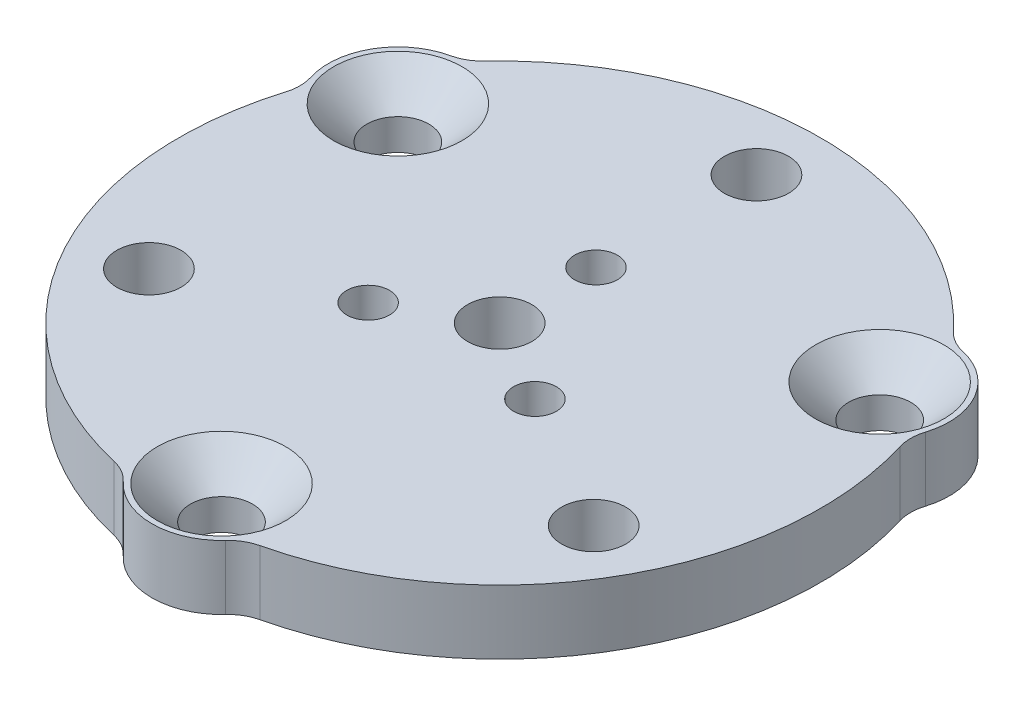
ISO-10303-21;
HEADER;
FILE_DESCRIPTION(('STEP AP214'),'2;1');
FILE_NAME('part.step','',(''),(''),'','','');
FILE_SCHEMA(('AUTOMOTIVE_DESIGN { 1 0 10303 214 1 1 1 1 }'));
ENDSEC;
DATA;
#1=APPLICATION_CONTEXT('core data for automotive mechanical design processes');
#2=APPLICATION_PROTOCOL_DEFINITION('international standard','automotive_design',2000,#1);
#3=PRODUCT_CONTEXT('',#1,'mechanical');
#4=PRODUCT('Part','Part','',(#3));
#5=PRODUCT_RELATED_PRODUCT_CATEGORY('part','',(#4));
#6=PRODUCT_DEFINITION_FORMATION('','',#4);
#7=PRODUCT_DEFINITION_CONTEXT('part definition',#1,'design');
#8=PRODUCT_DEFINITION('design','',#6,#7);
#9=PRODUCT_DEFINITION_SHAPE('','',#8);
#10=(LENGTH_UNIT() NAMED_UNIT(*) SI_UNIT(.MILLI.,.METRE.));
#11=(NAMED_UNIT(*) PLANE_ANGLE_UNIT() SI_UNIT($,.RADIAN.));
#12=(NAMED_UNIT(*) SI_UNIT($,.STERADIAN.) SOLID_ANGLE_UNIT());
#13=UNCERTAINTY_MEASURE_WITH_UNIT(LENGTH_MEASURE(1.E-05),#10,'distance_accuracy_value','');
#14=(GEOMETRIC_REPRESENTATION_CONTEXT(3) GLOBAL_UNCERTAINTY_ASSIGNED_CONTEXT((#13)) GLOBAL_UNIT_ASSIGNED_CONTEXT((#10,
#11,#12)) REPRESENTATION_CONTEXT('',''));
#15=CARTESIAN_POINT('',(0.,0.,0.));
#16=DIRECTION('',(0.,0.,1.));
#17=DIRECTION('',(1.,0.,0.));
#18=AXIS2_PLACEMENT_3D('',#15,#16,#17);
#19=CARTESIAN_POINT('',(0.,3.,0.));
#20=DIRECTION('',(0.,-1.,0.));
#21=DIRECTION('',(0.,0.,-1.));
#22=AXIS2_PLACEMENT_3D('',#19,#20,#21);
#23=CYLINDRICAL_SURFACE('',#22,15.);
#24=CARTESIAN_POINT('',(0.,3.,0.));
#25=DIRECTION('',(0.,1.,0.));
#26=DIRECTION('',(0.,0.,1.));
#27=AXIS2_PLACEMENT_3D('',#24,#25,#26);
#28=CIRCLE('',#27,15.);
#29=CARTESIAN_POINT('',(10.9463141513856,3.,-10.2556426663167));
#30=VERTEX_POINT('',#29);
#31=CARTESIAN_POINT('',(-10.9463141513855,3.,-10.2556426663168));
#32=VERTEX_POINT('',#31);
#33=EDGE_CURVE('E148',#30,#32,#28,.T.);
#34=ORIENTED_EDGE('',*,*,#33,.F.);
#35=DIRECTION('',(0.,-1.,0.));
#36=VECTOR('',#35,1.);
#37=CARTESIAN_POINT('',(10.9463141513856,3.,-10.2556426663167));
#38=LINE('',#37,#36);
#39=CARTESIAN_POINT('',(10.9463141513856,0.,-10.2556426663167));
#40=VERTEX_POINT('',#39);
#41=EDGE_CURVE('E133',#30,#40,#38,.T.);
#42=ORIENTED_EDGE('',*,*,#41,.T.);
#43=CARTESIAN_POINT('',(0.,0.,0.));
#44=DIRECTION('',(0.,1.,0.));
#45=DIRECTION('',(0.,0.,1.));
#46=AXIS2_PLACEMENT_3D('',#43,#44,#45);
#47=CIRCLE('',#46,15.);
#48=CARTESIAN_POINT('',(-10.9463141513855,0.,-10.2556426663168));
#49=VERTEX_POINT('',#48);
#50=EDGE_CURVE('E146',#40,#49,#47,.T.);
#51=ORIENTED_EDGE('',*,*,#50,.T.);
#52=DIRECTION('',(0.,-1.,0.));
#53=VECTOR('',#52,1.);
#54=CARTESIAN_POINT('',(-10.9463141513855,3.,-10.2556426663168));
#55=LINE('',#54,#53);
#56=EDGE_CURVE('E151',#49,#32,#55,.F.);
#57=ORIENTED_EDGE('',*,*,#56,.T.);
#58=EDGE_LOOP('',(#34,#42,#51,#57));
#59=FACE_BOUND('',#58,.T.);
#60=ADVANCED_FACE('F40',(#59),#23,.T.);
#61=CARTESIAN_POINT('',(-14.3548041568587,0.,-4.35196479974656));
#62=VERTEX_POINT('',#61);
#63=CARTESIAN_POINT('',(-3.40849000547315,0.,14.6076074660633));
#64=VERTEX_POINT('',#63);
#65=EDGE_CURVE('E160',#62,#64,#47,.T.);
#66=ORIENTED_EDGE('',*,*,#65,.T.);
#67=DIRECTION('',(0.,-1.,0.));
#68=VECTOR('',#67,1.);
#69=CARTESIAN_POINT('',(-3.40849000547315,3.,14.6076074660633));
#70=LINE('',#69,#68);
#71=CARTESIAN_POINT('',(-3.40849000547315,3.,14.6076074660633));
#72=VERTEX_POINT('',#71);
#73=EDGE_CURVE('E269',#64,#72,#70,.F.);
#74=ORIENTED_EDGE('',*,*,#73,.T.);
#75=CARTESIAN_POINT('',(-14.3548041568587,3.,-4.35196479974656));
#76=VERTEX_POINT('',#75);
#77=EDGE_CURVE('E167',#76,#72,#28,.T.);
#78=ORIENTED_EDGE('',*,*,#77,.F.);
#79=DIRECTION('',(0.,-1.,0.));
#80=VECTOR('',#79,1.);
#81=CARTESIAN_POINT('',(-14.3548041568587,3.,-4.35196479974656));
#82=LINE('',#81,#80);
#83=EDGE_CURVE('E265',#76,#62,#82,.T.);
#84=ORIENTED_EDGE('',*,*,#83,.T.);
#85=EDGE_LOOP('',(#66,#74,#78,#84));
#86=FACE_BOUND('',#85,.T.);
#87=ADVANCED_FACE('F387',(#86),#23,.T.);
#88=CARTESIAN_POINT('',(0.,3.,0.));
#89=DIRECTION('',(0.,1.,0.));
#90=DIRECTION('',(0.,0.,1.));
#91=AXIS2_PLACEMENT_3D('',#88,#89,#90);
#92=PLANE('',#91);
#93=CARTESIAN_POINT('',(-11.2583302491977,3.,-6.5));
#94=DIRECTION('',(0.,1.,0.));
#95=DIRECTION('',(0.,0.,1.));
#96=AXIS2_PLACEMENT_3D('',#93,#94,#95);
#97=CIRCLE('',#96,2.99999999999994);
#98=CARTESIAN_POINT('',(-11.2583302491977,3.,-3.50000000000005));
#99=VERTEX_POINT('',#98);
#100=EDGE_CURVE('E238',#99,#99,#97,.F.);
#101=ORIENTED_EDGE('',*,*,#100,.T.);
#102=EDGE_LOOP('',(#101));
#103=FACE_BOUND('',#102,.T.);
#104=CARTESIAN_POINT('',(0.,3.,13.));
#105=DIRECTION('',(0.,1.,0.));
#106=DIRECTION('',(0.,0.,1.));
#107=AXIS2_PLACEMENT_3D('',#104,#105,#106);
#108=CIRCLE('',#107,3.);
#109=CARTESIAN_POINT('',(0.,3.,16.));
#110=VERTEX_POINT('',#109);
#111=EDGE_CURVE('E234',#110,#110,#108,.F.);
#112=ORIENTED_EDGE('',*,*,#111,.T.);
#113=EDGE_LOOP('',(#112));
#114=FACE_BOUND('',#113,.T.);
#115=CARTESIAN_POINT('',(11.2583302491978,3.,-6.49999999999989));
#116=DIRECTION('',(0.,1.,0.));
#117=DIRECTION('',(0.,0.,1.));
#118=AXIS2_PLACEMENT_3D('',#115,#116,#117);
#119=CIRCLE('',#118,3.);
#120=CARTESIAN_POINT('',(11.2583302491978,3.,-3.49999999999989));
#121=VERTEX_POINT('',#120);
#122=EDGE_CURVE('E231',#121,#121,#119,.F.);
#123=ORIENTED_EDGE('',*,*,#122,.T.);
#124=EDGE_LOOP('',(#123));
#125=FACE_BOUND('',#124,.T.);
#126=CARTESIAN_POINT('',(11.2583302491978,3.,-6.49999999999989));
#127=DIRECTION('',(0.,1.,0.));
#128=DIRECTION('',(0.,0.,1.));
#129=AXIS2_PLACEMENT_3D('',#126,#127,#128);
#130=CIRCLE('',#129,3.25);
#131=CARTESIAN_POINT('',(14.3600360272048,3.,-5.52947371664746));
#132=VERTEX_POINT('',#131);
#133=CARTESIAN_POINT('',(11.9686827217776,3.,-9.67141914049515));
#134=VERTEX_POINT('',#133);
#135=EDGE_CURVE('E319',#132,#134,#130,.T.);
#136=ORIENTED_EDGE('',*,*,#135,.T.);
#137=CARTESIAN_POINT('',(12.4058227049037,3.,-11.6230616884922));
#138=DIRECTION('',(0.,1.,0.));
#139=DIRECTION('',(0.,0.,1.));
#140=AXIS2_PLACEMENT_3D('',#137,#138,#139);
#141=CIRCLE('',#140,2.);
#142=EDGE_CURVE('E140',#134,#30,#141,.F.);
#143=ORIENTED_EDGE('',*,*,#142,.T.);
#144=ORIENTED_EDGE('',*,*,#33,.T.);
#145=CARTESIAN_POINT('',(-12.4058227049036,3.,-11.6230616884923));
#146=DIRECTION('',(0.,1.,0.));
#147=DIRECTION('',(0.,0.,1.));
#148=AXIS2_PLACEMENT_3D('',#145,#146,#147);
#149=CIRCLE('',#148,2.);
#150=CARTESIAN_POINT('',(-11.9686827217775,3.,-9.67141914049526));
#151=VERTEX_POINT('',#150);
#152=EDGE_CURVE('E49',#32,#151,#149,.F.);
#153=ORIENTED_EDGE('',*,*,#152,.T.);
#154=CARTESIAN_POINT('',(-11.2583302491977,3.,-6.5));
#155=DIRECTION('',(0.,1.,0.));
#156=DIRECTION('',(0.,0.,1.));
#157=AXIS2_PLACEMENT_3D('',#154,#155,#156);
#158=CIRCLE('',#157,3.25);
#159=CARTESIAN_POINT('',(-14.3600360272047,3.,-5.52947371664759));
#160=VERTEX_POINT('',#159);
#161=EDGE_CURVE('E308',#151,#160,#158,.T.);
#162=ORIENTED_EDGE('',*,*,#161,.T.);
#163=CARTESIAN_POINT('',(-16.2687780444398,3.,-4.93222677304611));
#164=DIRECTION('',(0.,1.,0.));
#165=DIRECTION('',(0.,0.,1.));
#166=AXIS2_PLACEMENT_3D('',#163,#164,#165);
#167=CIRCLE('',#166,2.);
#168=EDGE_CURVE('E300',#160,#76,#167,.F.);
#169=ORIENTED_EDGE('',*,*,#168,.T.);
#170=ORIENTED_EDGE('',*,*,#77,.T.);
#171=CARTESIAN_POINT('',(-3.86295533953623,3.,16.5552884615385));
#172=DIRECTION('',(0.,1.,0.));
#173=DIRECTION('',(0.,0.,1.));
#174=AXIS2_PLACEMENT_3D('',#171,#172,#173);
#175=CIRCLE('',#174,2.);
#176=CARTESIAN_POINT('',(-2.39135330542719,3.,15.2008928571429));
#177=VERTEX_POINT('',#176);
#178=EDGE_CURVE('E291',#72,#177,#175,.F.);
#179=ORIENTED_EDGE('',*,*,#178,.T.);
#180=CARTESIAN_POINT('',(0.,3.,13.));
#181=DIRECTION('',(0.,1.,0.));
#182=DIRECTION('',(0.,0.,1.));
#183=AXIS2_PLACEMENT_3D('',#180,#181,#182);
#184=CIRCLE('',#183,3.25);
#185=CARTESIAN_POINT('',(2.39135330542719,3.,15.2008928571429));
#186=VERTEX_POINT('',#185);
#187=EDGE_CURVE('E307',#177,#186,#184,.T.);
#188=ORIENTED_EDGE('',*,*,#187,.T.);
#189=CARTESIAN_POINT('',(3.86295533953623,3.,16.5552884615385));
#190=DIRECTION('',(0.,1.,0.));
#191=DIRECTION('',(0.,0.,1.));
#192=AXIS2_PLACEMENT_3D('',#189,#190,#191);
#193=CIRCLE('',#192,2.);
#194=CARTESIAN_POINT('',(3.40849000547315,3.,14.6076074660633));
#195=VERTEX_POINT('',#194);
#196=EDGE_CURVE('E288',#186,#195,#193,.F.);
#197=ORIENTED_EDGE('',*,*,#196,.T.);
#198=CARTESIAN_POINT('',(14.3548041568587,3.,-4.35196479974643));
#199=VERTEX_POINT('',#198);
#200=EDGE_CURVE('E159',#195,#199,#28,.T.);
#201=ORIENTED_EDGE('',*,*,#200,.T.);
#202=CARTESIAN_POINT('',(16.2687780444399,3.,-4.93222677304596));
#203=DIRECTION('',(0.,1.,0.));
#204=DIRECTION('',(0.,0.,1.));
#205=AXIS2_PLACEMENT_3D('',#202,#203,#204);
#206=CIRCLE('',#205,2.);
#207=EDGE_CURVE('E280',#199,#132,#206,.F.);
#208=ORIENTED_EDGE('',*,*,#207,.T.);
#209=EDGE_LOOP('',(#136,#143,#144,#153,#162,#169,#170,#179,#188,#197,#201,#208));
#210=FACE_BOUND('',#209,.T.);
#211=CARTESIAN_POINT('',(3.89711431703029,3.,2.24999999999982));
#212=DIRECTION('',(0.,1.,0.));
#213=DIRECTION('',(0.,0.,1.));
#214=AXIS2_PLACEMENT_3D('',#211,#212,#213);
#215=CIRCLE('',#214,1.);
#216=CARTESIAN_POINT('',(3.89711431703029,3.,3.24999999999982));
#217=VERTEX_POINT('',#216);
#218=EDGE_CURVE('E331',#217,#217,#215,.T.);
#219=ORIENTED_EDGE('',*,*,#218,.F.);
#220=EDGE_LOOP('',(#219));
#221=FACE_BOUND('',#220,.T.);
#222=CARTESIAN_POINT('',(0.,3.,-4.5));
#223=DIRECTION('',(0.,1.,0.));
#224=DIRECTION('',(0.,0.,1.));
#225=AXIS2_PLACEMENT_3D('',#222,#223,#224);
#226=CIRCLE('',#225,1.);
#227=CARTESIAN_POINT('',(0.,3.,-3.5));
#228=VERTEX_POINT('',#227);
#229=EDGE_CURVE('E304',#228,#228,#226,.T.);
#230=ORIENTED_EDGE('',*,*,#229,.F.);
#231=EDGE_LOOP('',(#230));
#232=FACE_BOUND('',#231,.T.);
#233=CARTESIAN_POINT('',(10.3923048454133,3.,6.));
#234=DIRECTION('',(0.,1.,0.));
#235=DIRECTION('',(0.,0.,1.));
#236=AXIS2_PLACEMENT_3D('',#233,#234,#235);
#237=CIRCLE('',#236,1.50000000000006);
#238=CARTESIAN_POINT('',(10.3923048454133,3.,7.50000000000006));
#239=VERTEX_POINT('',#238);
#240=EDGE_CURVE('E353',#239,#239,#237,.T.);
#241=ORIENTED_EDGE('',*,*,#240,.F.);
#242=EDGE_LOOP('',(#241));
#243=FACE_BOUND('',#242,.T.);
#244=CARTESIAN_POINT('',(0.,3.,-12.));
#245=DIRECTION('',(0.,1.,0.));
#246=DIRECTION('',(0.,0.,1.));
#247=AXIS2_PLACEMENT_3D('',#244,#245,#246);
#248=CIRCLE('',#247,1.5);
#249=CARTESIAN_POINT('',(0.,3.,-10.5));
#250=VERTEX_POINT('',#249);
#251=EDGE_CURVE('E360',#250,#250,#248,.T.);
#252=ORIENTED_EDGE('',*,*,#251,.F.);
#253=EDGE_LOOP('',(#252));
#254=FACE_BOUND('',#253,.T.);
#255=CARTESIAN_POINT('',(-10.3923048454133,3.,6.00000000000001));
#256=DIRECTION('',(0.,1.,0.));
#257=DIRECTION('',(0.,0.,1.));
#258=AXIS2_PLACEMENT_3D('',#255,#256,#257);
#259=CIRCLE('',#258,1.50000000000011);
#260=CARTESIAN_POINT('',(-10.3923048454133,3.,7.50000000000011));
#261=VERTEX_POINT('',#260);
#262=EDGE_CURVE('E345',#261,#261,#259,.T.);
#263=ORIENTED_EDGE('',*,*,#262,.F.);
#264=EDGE_LOOP('',(#263));
#265=FACE_BOUND('',#264,.T.);
#266=CARTESIAN_POINT('',(0.,3.,0.));
#267=DIRECTION('',(0.,1.,0.));
#268=DIRECTION('',(0.,0.,1.));
#269=AXIS2_PLACEMENT_3D('',#266,#267,#268);
#270=CIRCLE('',#269,1.5);
#271=CARTESIAN_POINT('',(0.,3.,1.5));
#272=VERTEX_POINT('',#271);
#273=EDGE_CURVE('E336',#272,#272,#270,.T.);
#274=ORIENTED_EDGE('',*,*,#273,.F.);
#275=EDGE_LOOP('',(#274));
#276=FACE_BOUND('',#275,.T.);
#277=CARTESIAN_POINT('',(-3.89711431702965,3.,2.25000000000019));
#278=DIRECTION('',(0.,1.,0.));
#279=DIRECTION('',(0.,0.,1.));
#280=AXIS2_PLACEMENT_3D('',#277,#278,#279);
#281=CIRCLE('',#280,1.);
#282=CARTESIAN_POINT('',(-3.89711431702965,3.,3.25000000000019));
#283=VERTEX_POINT('',#282);
#284=EDGE_CURVE('E324',#283,#283,#281,.T.);
#285=ORIENTED_EDGE('',*,*,#284,.F.);
#286=EDGE_LOOP('',(#285));
#287=FACE_BOUND('',#286,.T.);
#288=ADVANCED_FACE('F393',(#103,#114,#125,#210,#221,#232,#243,#254,#265,#276,#287),#92,.T.);
#289=CARTESIAN_POINT('',(0.,0.,0.));
#290=DIRECTION('',(0.,1.,0.));
#291=DIRECTION('',(0.,0.,1.));
#292=AXIS2_PLACEMENT_3D('',#289,#290,#291);
#293=PLANE('',#292);
#294=CARTESIAN_POINT('',(3.89711431703029,0.,2.24999999999982));
#295=DIRECTION('',(0.,1.,0.));
#296=DIRECTION('',(0.,0.,1.));
#297=AXIS2_PLACEMENT_3D('',#294,#295,#296);
#298=CIRCLE('',#297,2.00000000000001);
#299=CARTESIAN_POINT('',(3.89711431703029,0.,4.24999999999982));
#300=VERTEX_POINT('',#299);
#301=EDGE_CURVE('E210',#300,#300,#298,.T.);
#302=ORIENTED_EDGE('',*,*,#301,.T.);
#303=EDGE_LOOP('',(#302));
#304=FACE_BOUND('',#303,.T.);
#305=CARTESIAN_POINT('',(-3.89711431702965,0.,2.25000000000019));
#306=DIRECTION('',(0.,1.,0.));
#307=DIRECTION('',(0.,0.,1.));
#308=AXIS2_PLACEMENT_3D('',#305,#306,#307);
#309=CIRCLE('',#308,2.);
#310=CARTESIAN_POINT('',(-3.89711431702965,0.,4.25000000000019));
#311=VERTEX_POINT('',#310);
#312=EDGE_CURVE('E204',#311,#311,#309,.T.);
#313=ORIENTED_EDGE('',*,*,#312,.T.);
#314=EDGE_LOOP('',(#313));
#315=FACE_BOUND('',#314,.T.);
#316=CARTESIAN_POINT('',(0.,0.,-4.5));
#317=DIRECTION('',(0.,1.,0.));
#318=DIRECTION('',(0.,0.,1.));
#319=AXIS2_PLACEMENT_3D('',#316,#317,#318);
#320=CIRCLE('',#319,2.00000000000001);
#321=CARTESIAN_POINT('',(0.,0.,-2.49999999999999));
#322=VERTEX_POINT('',#321);
#323=EDGE_CURVE('E201',#322,#322,#320,.T.);
#324=ORIENTED_EDGE('',*,*,#323,.T.);
#325=EDGE_LOOP('',(#324));
#326=FACE_BOUND('',#325,.T.);
#327=ORIENTED_EDGE('',*,*,#65,.F.);
#328=CARTESIAN_POINT('',(-16.2687780444398,0.,-4.93222677304611));
#329=DIRECTION('',(0.,1.,0.));
#330=DIRECTION('',(0.,0.,1.));
#331=AXIS2_PLACEMENT_3D('',#328,#329,#330);
#332=CIRCLE('',#331,2.);
#333=CARTESIAN_POINT('',(-14.3600360272047,0.,-5.52947371664759));
#334=VERTEX_POINT('',#333);
#335=EDGE_CURVE('E297',#62,#334,#332,.T.);
#336=ORIENTED_EDGE('',*,*,#335,.T.);
#337=CARTESIAN_POINT('',(-11.2583302491977,0.,-6.5));
#338=DIRECTION('',(0.,1.,0.));
#339=DIRECTION('',(0.,0.,1.));
#340=AXIS2_PLACEMENT_3D('',#337,#338,#339);
#341=CIRCLE('',#340,3.25);
#342=CARTESIAN_POINT('',(-11.9686827217775,0.,-9.67141914049526));
#343=VERTEX_POINT('',#342);
#344=EDGE_CURVE('E306',#334,#343,#341,.F.);
#345=ORIENTED_EDGE('',*,*,#344,.T.);
#346=CARTESIAN_POINT('',(-12.4058227049036,0.,-11.6230616884923));
#347=DIRECTION('',(0.,1.,0.));
#348=DIRECTION('',(0.,0.,1.));
#349=AXIS2_PLACEMENT_3D('',#346,#347,#348);
#350=CIRCLE('',#349,2.);
#351=EDGE_CURVE('E11',#343,#49,#350,.T.);
#352=ORIENTED_EDGE('',*,*,#351,.T.);
#353=ORIENTED_EDGE('',*,*,#50,.F.);
#354=CARTESIAN_POINT('',(12.4058227049037,0.,-11.6230616884922));
#355=DIRECTION('',(0.,1.,0.));
#356=DIRECTION('',(0.,0.,1.));
#357=AXIS2_PLACEMENT_3D('',#354,#355,#356);
#358=CIRCLE('',#357,2.);
#359=CARTESIAN_POINT('',(11.9686827217776,0.,-9.67141914049515));
#360=VERTEX_POINT('',#359);
#361=EDGE_CURVE('E129',#40,#360,#358,.T.);
#362=ORIENTED_EDGE('',*,*,#361,.T.);
#363=CARTESIAN_POINT('',(11.2583302491978,0.,-6.49999999999989));
#364=DIRECTION('',(0.,1.,0.));
#365=DIRECTION('',(0.,0.,1.));
#366=AXIS2_PLACEMENT_3D('',#363,#364,#365);
#367=CIRCLE('',#366,3.25);
#368=CARTESIAN_POINT('',(14.3600360272048,0.,-5.52947371664746));
#369=VERTEX_POINT('',#368);
#370=EDGE_CURVE('E321',#360,#369,#367,.F.);
#371=ORIENTED_EDGE('',*,*,#370,.T.);
#372=CARTESIAN_POINT('',(16.2687780444399,0.,-4.93222677304596));
#373=DIRECTION('',(0.,1.,0.));
#374=DIRECTION('',(0.,0.,1.));
#375=AXIS2_PLACEMENT_3D('',#372,#373,#374);
#376=CIRCLE('',#375,2.);
#377=CARTESIAN_POINT('',(14.3548041568587,0.,-4.35196479974643));
#378=VERTEX_POINT('',#377);
#379=EDGE_CURVE('E283',#369,#378,#376,.T.);
#380=ORIENTED_EDGE('',*,*,#379,.T.);
#381=CARTESIAN_POINT('',(3.40849000547315,0.,14.6076074660633));
#382=VERTEX_POINT('',#381);
#383=EDGE_CURVE('E162',#382,#378,#47,.T.);
#384=ORIENTED_EDGE('',*,*,#383,.F.);
#385=CARTESIAN_POINT('',(3.86295533953623,0.,16.5552884615385));
#386=DIRECTION('',(0.,1.,0.));
#387=DIRECTION('',(0.,0.,1.));
#388=AXIS2_PLACEMENT_3D('',#385,#386,#387);
#389=CIRCLE('',#388,2.);
#390=CARTESIAN_POINT('',(2.39135330542719,0.,15.2008928571429));
#391=VERTEX_POINT('',#390);
#392=EDGE_CURVE('E285',#382,#391,#389,.T.);
#393=ORIENTED_EDGE('',*,*,#392,.T.);
#394=CARTESIAN_POINT('',(0.,0.,13.));
#395=DIRECTION('',(0.,1.,0.));
#396=DIRECTION('',(0.,0.,1.));
#397=AXIS2_PLACEMENT_3D('',#394,#395,#396);
#398=CIRCLE('',#397,3.25);
#399=CARTESIAN_POINT('',(-2.39135330542719,0.,15.2008928571429));
#400=VERTEX_POINT('',#399);
#401=EDGE_CURVE('E312',#391,#400,#398,.F.);
#402=ORIENTED_EDGE('',*,*,#401,.T.);
#403=CARTESIAN_POINT('',(-3.86295533953623,0.,16.5552884615385));
#404=DIRECTION('',(0.,1.,0.));
#405=DIRECTION('',(0.,0.,1.));
#406=AXIS2_PLACEMENT_3D('',#403,#404,#405);
#407=CIRCLE('',#406,2.);
#408=EDGE_CURVE('E294',#400,#64,#407,.T.);
#409=ORIENTED_EDGE('',*,*,#408,.T.);
#410=EDGE_LOOP('',(#327,#336,#345,#352,#353,#362,#371,#380,#384,#393,#402,#409));
#411=FACE_BOUND('',#410,.T.);
#412=CARTESIAN_POINT('',(0.,0.,-12.));
#413=DIRECTION('',(0.,1.,0.));
#414=DIRECTION('',(0.,0.,1.));
#415=AXIS2_PLACEMENT_3D('',#412,#413,#414);
#416=CIRCLE('',#415,1.5);
#417=CARTESIAN_POINT('',(0.,0.,-10.5));
#418=VERTEX_POINT('',#417);
#419=EDGE_CURVE('E357',#418,#418,#416,.T.);
#420=ORIENTED_EDGE('',*,*,#419,.T.);
#421=EDGE_LOOP('',(#420));
#422=FACE_BOUND('',#421,.T.);
#423=CARTESIAN_POINT('',(10.3923048454133,0.,6.));
#424=DIRECTION('',(0.,1.,0.));
#425=DIRECTION('',(0.,0.,1.));
#426=AXIS2_PLACEMENT_3D('',#423,#424,#425);
#427=CIRCLE('',#426,1.50000000000006);
#428=CARTESIAN_POINT('',(10.3923048454133,0.,7.50000000000006));
#429=VERTEX_POINT('',#428);
#430=EDGE_CURVE('E349',#429,#429,#427,.T.);
#431=ORIENTED_EDGE('',*,*,#430,.T.);
#432=EDGE_LOOP('',(#431));
#433=FACE_BOUND('',#432,.T.);
#434=CARTESIAN_POINT('',(-10.3923048454133,0.,6.00000000000001));
#435=DIRECTION('',(0.,1.,0.));
#436=DIRECTION('',(0.,0.,1.));
#437=AXIS2_PLACEMENT_3D('',#434,#435,#436);
#438=CIRCLE('',#437,1.50000000000011);
#439=CARTESIAN_POINT('',(-10.3923048454133,0.,7.50000000000011));
#440=VERTEX_POINT('',#439);
#441=EDGE_CURVE('E344',#440,#440,#438,.T.);
#442=ORIENTED_EDGE('',*,*,#441,.T.);
#443=EDGE_LOOP('',(#442));
#444=FACE_BOUND('',#443,.T.);
#445=CARTESIAN_POINT('',(0.,0.,0.));
#446=DIRECTION('',(0.,1.,0.));
#447=DIRECTION('',(0.,0.,1.));
#448=AXIS2_PLACEMENT_3D('',#445,#446,#447);
#449=CIRCLE('',#448,1.5);
#450=CARTESIAN_POINT('',(0.,0.,1.5));
#451=VERTEX_POINT('',#450);
#452=EDGE_CURVE('E335',#451,#451,#449,.T.);
#453=ORIENTED_EDGE('',*,*,#452,.T.);
#454=EDGE_LOOP('',(#453));
#455=FACE_BOUND('',#454,.T.);
#456=CARTESIAN_POINT('',(11.2583302491978,0.,-6.49999999999989));
#457=DIRECTION('',(0.,1.,0.));
#458=DIRECTION('',(0.,0.,1.));
#459=AXIS2_PLACEMENT_3D('',#456,#457,#458);
#460=CIRCLE('',#459,1.45);
#461=CARTESIAN_POINT('',(11.2583302491978,0.,-5.04999999999989));
#462=VERTEX_POINT('',#461);
#463=EDGE_CURVE('E192',#462,#462,#460,.T.);
#464=ORIENTED_EDGE('',*,*,#463,.T.);
#465=EDGE_LOOP('',(#464));
#466=FACE_BOUND('',#465,.T.);
#467=CARTESIAN_POINT('',(0.,0.,13.));
#468=DIRECTION('',(0.,1.,0.));
#469=DIRECTION('',(0.,0.,1.));
#470=AXIS2_PLACEMENT_3D('',#467,#468,#469);
#471=CIRCLE('',#470,1.45);
#472=CARTESIAN_POINT('',(0.,0.,14.45));
#473=VERTEX_POINT('',#472);
#474=EDGE_CURVE('E174',#473,#473,#471,.T.);
#475=ORIENTED_EDGE('',*,*,#474,.T.);
#476=EDGE_LOOP('',(#475));
#477=FACE_BOUND('',#476,.T.);
#478=CARTESIAN_POINT('',(-11.2583302491977,0.,-6.5));
#479=DIRECTION('',(0.,1.,0.));
#480=DIRECTION('',(0.,0.,1.));
#481=AXIS2_PLACEMENT_3D('',#478,#479,#480);
#482=CIRCLE('',#481,1.44999999999994);
#483=CARTESIAN_POINT('',(-11.2583302491977,0.,-5.05000000000006));
#484=VERTEX_POINT('',#483);
#485=EDGE_CURVE('E184',#484,#484,#482,.T.);
#486=ORIENTED_EDGE('',*,*,#485,.T.);
#487=EDGE_LOOP('',(#486));
#488=FACE_BOUND('',#487,.T.);
#489=ADVANCED_FACE('F154',(#304,#315,#326,#411,#422,#433,#444,#455,#466,#477,#488),#293,.F.);
#490=ORIENTED_EDGE('',*,*,#383,.T.);
#491=DIRECTION('',(0.,-1.,0.));
#492=VECTOR('',#491,1.);
#493=CARTESIAN_POINT('',(14.3548041568587,3.,-4.35196479974643));
#494=LINE('',#493,#492);
#495=EDGE_CURVE('E256',#378,#199,#494,.F.);
#496=ORIENTED_EDGE('',*,*,#495,.T.);
#497=ORIENTED_EDGE('',*,*,#200,.F.);
#498=DIRECTION('',(0.,-1.,0.));
#499=VECTOR('',#498,1.);
#500=CARTESIAN_POINT('',(3.40849000547315,3.,14.6076074660633));
#501=LINE('',#500,#499);
#502=EDGE_CURVE('E254',#195,#382,#501,.T.);
#503=ORIENTED_EDGE('',*,*,#502,.T.);
#504=EDGE_LOOP('',(#490,#496,#497,#503));
#505=FACE_BOUND('',#504,.T.);
#506=ADVANCED_FACE('F389',(#505),#23,.T.);
#507=CARTESIAN_POINT('',(0.,3.,13.));
#508=DIRECTION('',(0.,-1.,0.));
#509=DIRECTION('',(0.,0.,-1.));
#510=AXIS2_PLACEMENT_3D('',#507,#508,#509);
#511=CYLINDRICAL_SURFACE('',#510,1.45);
#512=CARTESIAN_POINT('',(0.,1.45,13.));
#513=DIRECTION('',(0.,1.,0.));
#514=DIRECTION('',(0.,0.,1.));
#515=AXIS2_PLACEMENT_3D('',#512,#513,#514);
#516=CIRCLE('',#515,1.45);
#517=CARTESIAN_POINT('',(0.,1.45,14.45));
#518=VERTEX_POINT('',#517);
#519=EDGE_CURVE('E242',#518,#518,#516,.T.);
#520=ORIENTED_EDGE('',*,*,#519,.T.);
#521=EDGE_LOOP('',(#520));
#522=FACE_BOUND('',#521,.T.);
#523=ORIENTED_EDGE('',*,*,#474,.F.);
#524=EDGE_LOOP('',(#523));
#525=FACE_BOUND('',#524,.T.);
#526=ADVANCED_FACE('F383',(#522,#525),#511,.F.);
#527=CARTESIAN_POINT('',(-11.2583302491977,3.,-6.5));
#528=DIRECTION('',(0.,-1.,0.));
#529=DIRECTION('',(0.,0.,-1.));
#530=AXIS2_PLACEMENT_3D('',#527,#528,#529);
#531=CYLINDRICAL_SURFACE('',#530,1.44999999999994);
#532=CARTESIAN_POINT('',(-11.2583302491977,1.45,-6.5));
#533=DIRECTION('',(0.,1.,0.));
#534=DIRECTION('',(0.,0.,1.));
#535=AXIS2_PLACEMENT_3D('',#532,#533,#534);
#536=CIRCLE('',#535,1.44999999999994);
#537=CARTESIAN_POINT('',(-11.2583302491977,1.45,-5.05000000000006));
#538=VERTEX_POINT('',#537);
#539=EDGE_CURVE('E227',#538,#538,#536,.T.);
#540=ORIENTED_EDGE('',*,*,#539,.T.);
#541=EDGE_LOOP('',(#540));
#542=FACE_BOUND('',#541,.T.);
#543=ORIENTED_EDGE('',*,*,#485,.F.);
#544=EDGE_LOOP('',(#543));
#545=FACE_BOUND('',#544,.T.);
#546=ADVANCED_FACE('F373',(#542,#545),#531,.F.);
#547=CARTESIAN_POINT('',(11.2583302491978,3.,-6.49999999999989));
#548=DIRECTION('',(0.,-1.,0.));
#549=DIRECTION('',(0.,0.,-1.));
#550=AXIS2_PLACEMENT_3D('',#547,#548,#549);
#551=CYLINDRICAL_SURFACE('',#550,1.45);
#552=CARTESIAN_POINT('',(11.2583302491978,1.45,-6.49999999999989));
#553=DIRECTION('',(0.,1.,0.));
#554=DIRECTION('',(0.,0.,1.));
#555=AXIS2_PLACEMENT_3D('',#552,#553,#554);
#556=CIRCLE('',#555,1.45);
#557=CARTESIAN_POINT('',(11.2583302491978,1.45,-5.04999999999989));
#558=VERTEX_POINT('',#557);
#559=EDGE_CURVE('E246',#558,#558,#556,.T.);
#560=ORIENTED_EDGE('',*,*,#559,.T.);
#561=EDGE_LOOP('',(#560));
#562=FACE_BOUND('',#561,.T.);
#563=ORIENTED_EDGE('',*,*,#463,.F.);
#564=EDGE_LOOP('',(#563));
#565=FACE_BOUND('',#564,.T.);
#566=ADVANCED_FACE('F370',(#562,#565),#551,.F.);
#567=CARTESIAN_POINT('',(0.,3.,-12.));
#568=DIRECTION('',(0.,-1.,0.));
#569=DIRECTION('',(0.,0.,-1.));
#570=AXIS2_PLACEMENT_3D('',#567,#568,#569);
#571=CYLINDRICAL_SURFACE('',#570,1.5);
#572=ORIENTED_EDGE('',*,*,#251,.T.);
#573=EDGE_LOOP('',(#572));
#574=FACE_BOUND('',#573,.T.);
#575=ORIENTED_EDGE('',*,*,#419,.F.);
#576=EDGE_LOOP('',(#575));
#577=FACE_BOUND('',#576,.T.);
#578=ADVANCED_FACE('F372',(#574,#577),#571,.F.);
#579=CARTESIAN_POINT('',(10.3923048454133,3.,6.));
#580=DIRECTION('',(0.,-1.,0.));
#581=DIRECTION('',(0.,0.,-1.));
#582=AXIS2_PLACEMENT_3D('',#579,#580,#581);
#583=CYLINDRICAL_SURFACE('',#582,1.50000000000006);
#584=ORIENTED_EDGE('',*,*,#240,.T.);
#585=EDGE_LOOP('',(#584));
#586=FACE_BOUND('',#585,.T.);
#587=ORIENTED_EDGE('',*,*,#430,.F.);
#588=EDGE_LOOP('',(#587));
#589=FACE_BOUND('',#588,.T.);
#590=ADVANCED_FACE('F380',(#586,#589),#583,.F.);
#591=CARTESIAN_POINT('',(-10.3923048454133,3.,6.00000000000001));
#592=DIRECTION('',(0.,-1.,0.));
#593=DIRECTION('',(0.,0.,-1.));
#594=AXIS2_PLACEMENT_3D('',#591,#592,#593);
#595=CYLINDRICAL_SURFACE('',#594,1.50000000000011);
#596=ORIENTED_EDGE('',*,*,#262,.T.);
#597=EDGE_LOOP('',(#596));
#598=FACE_BOUND('',#597,.T.);
#599=ORIENTED_EDGE('',*,*,#441,.F.);
#600=EDGE_LOOP('',(#599));
#601=FACE_BOUND('',#600,.T.);
#602=ADVANCED_FACE('F522',(#598,#601),#595,.F.);
#603=CARTESIAN_POINT('',(0.,3.,-4.5));
#604=DIRECTION('',(0.,-1.,0.));
#605=DIRECTION('',(0.,0.,-1.));
#606=AXIS2_PLACEMENT_3D('',#603,#604,#605);
#607=CYLINDRICAL_SURFACE('',#606,1.);
#608=CARTESIAN_POINT('',(0.,1.00000000000001,-4.5));
#609=DIRECTION('',(0.,1.,0.));
#610=DIRECTION('',(0.,0.,1.));
#611=AXIS2_PLACEMENT_3D('',#608,#609,#610);
#612=CIRCLE('',#611,1.);
#613=CARTESIAN_POINT('',(0.,1.00000000000001,-3.5));
#614=VERTEX_POINT('',#613);
#615=EDGE_CURVE('E224',#614,#614,#612,.F.);
#616=ORIENTED_EDGE('',*,*,#615,.T.);
#617=EDGE_LOOP('',(#616));
#618=FACE_BOUND('',#617,.T.);
#619=ORIENTED_EDGE('',*,*,#229,.T.);
#620=EDGE_LOOP('',(#619));
#621=FACE_BOUND('',#620,.T.);
#622=ADVANCED_FACE('F518',(#618,#621),#607,.F.);
#623=CARTESIAN_POINT('',(0.,3.,0.));
#624=DIRECTION('',(0.,-1.,0.));
#625=DIRECTION('',(0.,0.,-1.));
#626=AXIS2_PLACEMENT_3D('',#623,#624,#625);
#627=CYLINDRICAL_SURFACE('',#626,1.5);
#628=ORIENTED_EDGE('',*,*,#273,.T.);
#629=EDGE_LOOP('',(#628));
#630=FACE_BOUND('',#629,.T.);
#631=ORIENTED_EDGE('',*,*,#452,.F.);
#632=EDGE_LOOP('',(#631));
#633=FACE_BOUND('',#632,.T.);
#634=ADVANCED_FACE('F514',(#630,#633),#627,.F.);
#635=CARTESIAN_POINT('',(3.89711431703029,3.,2.24999999999982));
#636=DIRECTION('',(0.,-1.,0.));
#637=DIRECTION('',(0.,0.,-1.));
#638=AXIS2_PLACEMENT_3D('',#635,#636,#637);
#639=CYLINDRICAL_SURFACE('',#638,1.);
#640=CARTESIAN_POINT('',(3.89711431703029,1.,2.24999999999982));
#641=DIRECTION('',(0.,1.,0.));
#642=DIRECTION('',(0.,0.,1.));
#643=AXIS2_PLACEMENT_3D('',#640,#641,#642);
#644=CIRCLE('',#643,1.);
#645=CARTESIAN_POINT('',(3.89711431703029,1.,3.24999999999982));
#646=VERTEX_POINT('',#645);
#647=EDGE_CURVE('E216',#646,#646,#644,.F.);
#648=ORIENTED_EDGE('',*,*,#647,.T.);
#649=EDGE_LOOP('',(#648));
#650=FACE_BOUND('',#649,.T.);
#651=ORIENTED_EDGE('',*,*,#218,.T.);
#652=EDGE_LOOP('',(#651));
#653=FACE_BOUND('',#652,.T.);
#654=ADVANCED_FACE('F510',(#650,#653),#639,.F.);
#655=CARTESIAN_POINT('',(-3.89711431702965,3.,2.25000000000019));
#656=DIRECTION('',(0.,-1.,0.));
#657=DIRECTION('',(0.,0.,-1.));
#658=AXIS2_PLACEMENT_3D('',#655,#656,#657);
#659=CYLINDRICAL_SURFACE('',#658,1.);
#660=CARTESIAN_POINT('',(-3.89711431702965,1.00000000000001,2.25000000000019));
#661=DIRECTION('',(0.,1.,0.));
#662=DIRECTION('',(0.,0.,1.));
#663=AXIS2_PLACEMENT_3D('',#660,#661,#662);
#664=CIRCLE('',#663,1.);
#665=CARTESIAN_POINT('',(-3.89711431702965,1.00000000000001,3.25000000000019));
#666=VERTEX_POINT('',#665);
#667=EDGE_CURVE('E220',#666,#666,#664,.F.);
#668=ORIENTED_EDGE('',*,*,#667,.T.);
#669=EDGE_LOOP('',(#668));
#670=FACE_BOUND('',#669,.T.);
#671=ORIENTED_EDGE('',*,*,#284,.T.);
#672=EDGE_LOOP('',(#671));
#673=FACE_BOUND('',#672,.T.);
#674=ADVANCED_FACE('F427',(#670,#673),#659,.F.);
#675=CARTESIAN_POINT('',(3.89711431703029,0.,2.24999999999982));
#676=DIRECTION('',(0.,-1.,0.));
#677=DIRECTION('',(0.,0.,-1.));
#678=AXIS2_PLACEMENT_3D('',#675,#676,#677);
#679=CONICAL_SURFACE('',#678,2.00000000000001,0.785398163397448);
#680=ORIENTED_EDGE('',*,*,#647,.F.);
#681=EDGE_LOOP('',(#680));
#682=FACE_BOUND('',#681,.T.);
#683=ORIENTED_EDGE('',*,*,#301,.F.);
#684=EDGE_LOOP('',(#683));
#685=FACE_BOUND('',#684,.T.);
#686=ADVANCED_FACE('F417',(#682,#685),#679,.F.);
#687=CARTESIAN_POINT('',(-3.89711431702965,0.,2.25000000000019));
#688=DIRECTION('',(0.,-1.,0.));
#689=DIRECTION('',(0.,0.,-1.));
#690=AXIS2_PLACEMENT_3D('',#687,#688,#689);
#691=CONICAL_SURFACE('',#690,2.00000000000001,0.785398163397448);
#692=ORIENTED_EDGE('',*,*,#667,.F.);
#693=EDGE_LOOP('',(#692));
#694=FACE_BOUND('',#693,.T.);
#695=ORIENTED_EDGE('',*,*,#312,.F.);
#696=EDGE_LOOP('',(#695));
#697=FACE_BOUND('',#696,.T.);
#698=ADVANCED_FACE('F414',(#694,#697),#691,.F.);
#699=CARTESIAN_POINT('',(0.,0.,-4.5));
#700=DIRECTION('',(0.,-1.,0.));
#701=DIRECTION('',(0.,0.,-1.));
#702=AXIS2_PLACEMENT_3D('',#699,#700,#701);
#703=CONICAL_SURFACE('',#702,2.00000000000001,0.785398163397448);
#704=ORIENTED_EDGE('',*,*,#615,.F.);
#705=EDGE_LOOP('',(#704));
#706=FACE_BOUND('',#705,.T.);
#707=ORIENTED_EDGE('',*,*,#323,.F.);
#708=EDGE_LOOP('',(#707));
#709=FACE_BOUND('',#708,.T.);
#710=ADVANCED_FACE('F416',(#706,#709),#703,.F.);
#711=CARTESIAN_POINT('',(11.2583302491978,-9.19238815542512,-6.49999999999989));
#712=DIRECTION('',(0.,1.,0.));
#713=DIRECTION('',(0.,0.,1.));
#714=AXIS2_PLACEMENT_3D('',#711,#712,#713);
#715=CYLINDRICAL_SURFACE('',#714,3.25);
#716=ORIENTED_EDGE('',*,*,#370,.F.);
#717=DIRECTION('',(0.,1.,0.));
#718=VECTOR('',#717,1.);
#719=CARTESIAN_POINT('',(11.9686827217776,-9.19238815542512,-9.67141914049515));
#720=LINE('',#719,#718);
#721=EDGE_CURVE('E134',#360,#134,#720,.T.);
#722=ORIENTED_EDGE('',*,*,#721,.T.);
#723=ORIENTED_EDGE('',*,*,#135,.F.);
#724=DIRECTION('',(0.,1.,0.));
#725=VECTOR('',#724,1.);
#726=CARTESIAN_POINT('',(14.3600360272048,-9.19238815542512,-5.52947371664746));
#727=LINE('',#726,#725);
#728=EDGE_CURVE('E150',#132,#369,#727,.F.);
#729=ORIENTED_EDGE('',*,*,#728,.T.);
#730=EDGE_LOOP('',(#716,#722,#723,#729));
#731=FACE_BOUND('',#730,.T.);
#732=ADVANCED_FACE('F424',(#731),#715,.T.);
#733=CARTESIAN_POINT('',(0.,-9.19238815542512,13.));
#734=DIRECTION('',(0.,1.,0.));
#735=DIRECTION('',(0.,0.,1.));
#736=AXIS2_PLACEMENT_3D('',#733,#734,#735);
#737=CYLINDRICAL_SURFACE('',#736,3.25);
#738=ORIENTED_EDGE('',*,*,#401,.F.);
#739=DIRECTION('',(0.,1.,0.));
#740=VECTOR('',#739,1.);
#741=CARTESIAN_POINT('',(2.39135330542719,-9.19238815542512,15.2008928571429));
#742=LINE('',#741,#740);
#743=EDGE_CURVE('E262',#391,#186,#742,.T.);
#744=ORIENTED_EDGE('',*,*,#743,.T.);
#745=ORIENTED_EDGE('',*,*,#187,.F.);
#746=DIRECTION('',(0.,1.,0.));
#747=VECTOR('',#746,1.);
#748=CARTESIAN_POINT('',(-2.39135330542719,-9.19238815542512,15.2008928571429));
#749=LINE('',#748,#747);
#750=EDGE_CURVE('E259',#177,#400,#749,.F.);
#751=ORIENTED_EDGE('',*,*,#750,.T.);
#752=EDGE_LOOP('',(#738,#744,#745,#751));
#753=FACE_BOUND('',#752,.T.);
#754=ADVANCED_FACE('F490',(#753),#737,.T.);
#755=CARTESIAN_POINT('',(-11.2583302491977,-9.19238815542512,-6.5));
#756=DIRECTION('',(0.,1.,0.));
#757=DIRECTION('',(0.,0.,1.));
#758=AXIS2_PLACEMENT_3D('',#755,#756,#757);
#759=CYLINDRICAL_SURFACE('',#758,3.25);
#760=ORIENTED_EDGE('',*,*,#344,.F.);
#761=DIRECTION('',(0.,1.,0.));
#762=VECTOR('',#761,1.);
#763=CARTESIAN_POINT('',(-14.3600360272047,-9.19238815542512,-5.52947371664759));
#764=LINE('',#763,#762);
#765=EDGE_CURVE('E56',#334,#160,#764,.T.);
#766=ORIENTED_EDGE('',*,*,#765,.T.);
#767=ORIENTED_EDGE('',*,*,#161,.F.);
#768=DIRECTION('',(0.,1.,0.));
#769=VECTOR('',#768,1.);
#770=CARTESIAN_POINT('',(-11.9686827217775,-9.19238815542512,-9.67141914049526));
#771=LINE('',#770,#769);
#772=EDGE_CURVE('E273',#151,#343,#771,.F.);
#773=ORIENTED_EDGE('',*,*,#772,.T.);
#774=EDGE_LOOP('',(#760,#766,#767,#773));
#775=FACE_BOUND('',#774,.T.);
#776=ADVANCED_FACE('F446',(#775),#759,.T.);
#777=CARTESIAN_POINT('',(-11.2583302491977,1.45,-6.5));
#778=DIRECTION('',(0.,1.,0.));
#779=DIRECTION('',(0.,0.,1.));
#780=AXIS2_PLACEMENT_3D('',#777,#778,#779);
#781=CONICAL_SURFACE('',#780,1.44999999999994,0.785398163397449);
#782=ORIENTED_EDGE('',*,*,#100,.F.);
#783=EDGE_LOOP('',(#782));
#784=FACE_BOUND('',#783,.T.);
#785=ORIENTED_EDGE('',*,*,#539,.F.);
#786=EDGE_LOOP('',(#785));
#787=FACE_BOUND('',#786,.T.);
#788=ADVANCED_FACE('F439',(#784,#787),#781,.F.);
#789=CARTESIAN_POINT('',(0.,1.45,13.));
#790=DIRECTION('',(0.,1.,0.));
#791=DIRECTION('',(0.,0.,1.));
#792=AXIS2_PLACEMENT_3D('',#789,#790,#791);
#793=CONICAL_SURFACE('',#792,1.45,0.785398163397449);
#794=ORIENTED_EDGE('',*,*,#111,.F.);
#795=EDGE_LOOP('',(#794));
#796=FACE_BOUND('',#795,.T.);
#797=ORIENTED_EDGE('',*,*,#519,.F.);
#798=EDGE_LOOP('',(#797));
#799=FACE_BOUND('',#798,.T.);
#800=ADVANCED_FACE('F445',(#796,#799),#793,.F.);
#801=CARTESIAN_POINT('',(11.2583302491978,1.45,-6.49999999999989));
#802=DIRECTION('',(0.,1.,0.));
#803=DIRECTION('',(0.,0.,1.));
#804=AXIS2_PLACEMENT_3D('',#801,#802,#803);
#805=CONICAL_SURFACE('',#804,1.45,0.785398163397449);
#806=ORIENTED_EDGE('',*,*,#122,.F.);
#807=EDGE_LOOP('',(#806));
#808=FACE_BOUND('',#807,.T.);
#809=ORIENTED_EDGE('',*,*,#559,.F.);
#810=EDGE_LOOP('',(#809));
#811=FACE_BOUND('',#810,.T.);
#812=ADVANCED_FACE('F453',(#808,#811),#805,.F.);
#813=CARTESIAN_POINT('',(12.4058227049037,-9.19238815542512,-11.6230616884922));
#814=DIRECTION('',(0.,1.,0.));
#815=DIRECTION('',(0.,0.,1.));
#816=AXIS2_PLACEMENT_3D('',#813,#814,#815);
#817=CYLINDRICAL_SURFACE('',#816,2.);
#818=ORIENTED_EDGE('',*,*,#142,.F.);
#819=ORIENTED_EDGE('',*,*,#721,.F.);
#820=ORIENTED_EDGE('',*,*,#361,.F.);
#821=ORIENTED_EDGE('',*,*,#41,.F.);
#822=EDGE_LOOP('',(#818,#819,#820,#821));
#823=FACE_BOUND('',#822,.T.);
#824=ADVANCED_FACE('F132',(#823),#817,.F.);
#825=CARTESIAN_POINT('',(16.2687780444399,-9.19238815542512,-4.93222677304596));
#826=DIRECTION('',(0.,-1.,0.));
#827=DIRECTION('',(0.,0.,-1.));
#828=AXIS2_PLACEMENT_3D('',#825,#826,#827);
#829=CYLINDRICAL_SURFACE('',#828,2.);
#830=ORIENTED_EDGE('',*,*,#379,.F.);
#831=ORIENTED_EDGE('',*,*,#728,.F.);
#832=ORIENTED_EDGE('',*,*,#207,.F.);
#833=ORIENTED_EDGE('',*,*,#495,.F.);
#834=EDGE_LOOP('',(#830,#831,#832,#833));
#835=FACE_BOUND('',#834,.T.);
#836=ADVANCED_FACE('F462',(#835),#829,.F.);
#837=CARTESIAN_POINT('',(3.86295533953623,-9.19238815542512,16.5552884615385));
#838=DIRECTION('',(0.,1.,0.));
#839=DIRECTION('',(0.,0.,1.));
#840=AXIS2_PLACEMENT_3D('',#837,#838,#839);
#841=CYLINDRICAL_SURFACE('',#840,2.);
#842=ORIENTED_EDGE('',*,*,#196,.F.);
#843=ORIENTED_EDGE('',*,*,#743,.F.);
#844=ORIENTED_EDGE('',*,*,#392,.F.);
#845=ORIENTED_EDGE('',*,*,#502,.F.);
#846=EDGE_LOOP('',(#842,#843,#844,#845));
#847=FACE_BOUND('',#846,.T.);
#848=ADVANCED_FACE('F465',(#847),#841,.F.);
#849=CARTESIAN_POINT('',(-3.86295533953623,-9.19238815542512,16.5552884615385));
#850=DIRECTION('',(0.,-1.,0.));
#851=DIRECTION('',(0.,0.,-1.));
#852=AXIS2_PLACEMENT_3D('',#849,#850,#851);
#853=CYLINDRICAL_SURFACE('',#852,2.);
#854=ORIENTED_EDGE('',*,*,#408,.F.);
#855=ORIENTED_EDGE('',*,*,#750,.F.);
#856=ORIENTED_EDGE('',*,*,#178,.F.);
#857=ORIENTED_EDGE('',*,*,#73,.F.);
#858=EDGE_LOOP('',(#854,#855,#856,#857));
#859=FACE_BOUND('',#858,.T.);
#860=ADVANCED_FACE('F469',(#859),#853,.F.);
#861=CARTESIAN_POINT('',(-16.2687780444398,-9.19238815542512,-4.93222677304611));
#862=DIRECTION('',(0.,1.,0.));
#863=DIRECTION('',(0.,0.,1.));
#864=AXIS2_PLACEMENT_3D('',#861,#862,#863);
#865=CYLINDRICAL_SURFACE('',#864,2.);
#866=ORIENTED_EDGE('',*,*,#168,.F.);
#867=ORIENTED_EDGE('',*,*,#765,.F.);
#868=ORIENTED_EDGE('',*,*,#335,.F.);
#869=ORIENTED_EDGE('',*,*,#83,.F.);
#870=EDGE_LOOP('',(#866,#867,#868,#869));
#871=FACE_BOUND('',#870,.T.);
#872=ADVANCED_FACE('F472',(#871),#865,.F.);
#873=CARTESIAN_POINT('',(-12.4058227049036,-9.19238815542512,-11.6230616884923));
#874=DIRECTION('',(0.,-1.,0.));
#875=DIRECTION('',(0.,0.,-1.));
#876=AXIS2_PLACEMENT_3D('',#873,#874,#875);
#877=CYLINDRICAL_SURFACE('',#876,2.);
#878=ORIENTED_EDGE('',*,*,#351,.F.);
#879=ORIENTED_EDGE('',*,*,#772,.F.);
#880=ORIENTED_EDGE('',*,*,#152,.F.);
#881=ORIENTED_EDGE('',*,*,#56,.F.);
#882=EDGE_LOOP('',(#878,#879,#880,#881));
#883=FACE_BOUND('',#882,.T.);
#884=ADVANCED_FACE('F42',(#883),#877,.F.);
#885=CLOSED_SHELL('',(#60,#87,#288,#489,#506,#526,#546,#566,#578,#590,#602,#622,#634,#654,#674,
#686,#698,#710,#732,#754,#776,#788,#800,#812,#824,#836,#848,#860,#872,#884));
#886=MANIFOLD_SOLID_BREP('B2',#885);
#887=ADVANCED_BREP_SHAPE_REPRESENTATION('',(#18,#886),#14);
#888=SHAPE_DEFINITION_REPRESENTATION(#9,#887);
ENDSEC;
END-ISO-10303-21;
